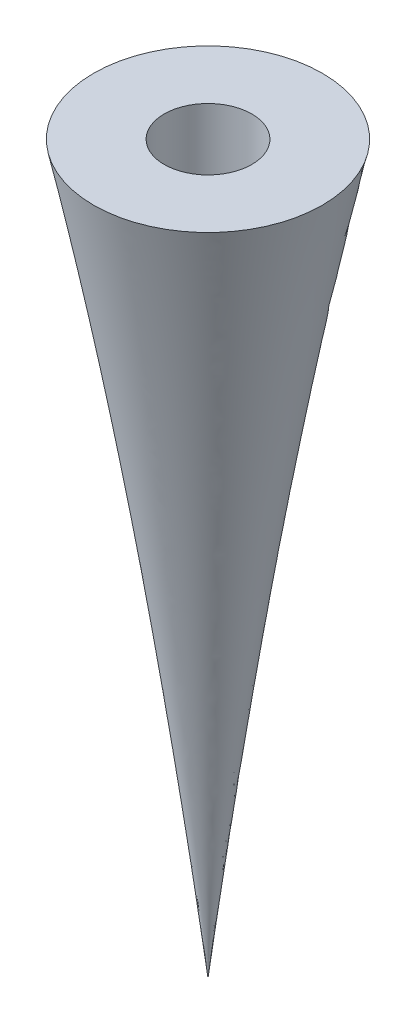
ISO-10303-21;
HEADER;
FILE_DESCRIPTION(('STEP AP214'),'2;1');
FILE_NAME('part.step','',(''),(''),'','','');
FILE_SCHEMA(('AUTOMOTIVE_DESIGN { 1 0 10303 214 1 1 1 1 }'));
ENDSEC;
DATA;
#1=APPLICATION_CONTEXT('core data for automotive mechanical design processes');
#2=APPLICATION_PROTOCOL_DEFINITION('international standard','automotive_design',2000,#1);
#3=PRODUCT_CONTEXT('',#1,'mechanical');
#4=PRODUCT('Part','Part','',(#3));
#5=PRODUCT_RELATED_PRODUCT_CATEGORY('part','',(#4));
#6=PRODUCT_DEFINITION_FORMATION('','',#4);
#7=PRODUCT_DEFINITION_CONTEXT('part definition',#1,'design');
#8=PRODUCT_DEFINITION('design','',#6,#7);
#9=PRODUCT_DEFINITION_SHAPE('','',#8);
#10=(LENGTH_UNIT() NAMED_UNIT(*) SI_UNIT(.MILLI.,.METRE.));
#11=(NAMED_UNIT(*) PLANE_ANGLE_UNIT() SI_UNIT($,.RADIAN.));
#12=(NAMED_UNIT(*) SI_UNIT($,.STERADIAN.) SOLID_ANGLE_UNIT());
#13=UNCERTAINTY_MEASURE_WITH_UNIT(LENGTH_MEASURE(1.E-05),#10,'distance_accuracy_value','');
#14=(GEOMETRIC_REPRESENTATION_CONTEXT(3) GLOBAL_UNCERTAINTY_ASSIGNED_CONTEXT((#13)) GLOBAL_UNIT_ASSIGNED_CONTEXT((#10,
#11,#12)) REPRESENTATION_CONTEXT('',''));
#15=CARTESIAN_POINT('',(0.,0.,0.));
#16=DIRECTION('',(0.,0.,1.));
#17=DIRECTION('',(1.,0.,0.));
#18=AXIS2_PLACEMENT_3D('',#15,#16,#17);
#19=CARTESIAN_POINT('',(0.,-22.5,0.));
#20=DIRECTION('',(0.,-1.,0.));
#21=DIRECTION('',(0.,0.,-1.));
#22=AXIS2_PLACEMENT_3D('',#19,#20,#21);
#23=PLANE('',#22);
#24=CARTESIAN_POINT('',(0.,-22.5,0.));
#25=DIRECTION('',(0.,-1.,0.));
#26=DIRECTION('',(0.,0.,-1.));
#27=AXIS2_PLACEMENT_3D('',#24,#25,#26);
#28=CIRCLE('',#27,4.14304083359019);
#29=CARTESIAN_POINT('',(0.,-22.5,-4.14304083359019));
#30=VERTEX_POINT('',#29);
#31=EDGE_CURVE('E11',#30,#30,#28,.T.);
#32=ORIENTED_EDGE('',*,*,#31,.F.);
#33=EDGE_LOOP('',(#32));
#34=FACE_BOUND('',#33,.T.);
#35=CARTESIAN_POINT('',(0.,-22.5,0.));
#36=DIRECTION('',(0.,-1.,0.));
#37=DIRECTION('',(0.,0.,-1.));
#38=AXIS2_PLACEMENT_3D('',#35,#36,#37);
#39=CIRCLE('',#38,1.5875);
#40=CARTESIAN_POINT('',(0.,-22.5,-1.5875));
#41=VERTEX_POINT('',#40);
#42=EDGE_CURVE('E56',#41,#41,#39,.T.);
#43=ORIENTED_EDGE('',*,*,#42,.T.);
#44=EDGE_LOOP('',(#43));
#45=FACE_BOUND('',#44,.T.);
#46=ADVANCED_FACE('F37',(#34,#45),#23,.F.);
#47=CARTESIAN_POINT('',(0.,0.6058,14.8325));
#48=CARTESIAN_POINT('',(0.,0.594107912206373,14.7865895270144));
#49=CARTESIAN_POINT('',(0.,0.577188139103916,14.7201518813473));
#50=CARTESIAN_POINT('',(0.,0.555651214039472,14.6369424777007));
#51=CARTESIAN_POINT('',(0.,0.541606050783031,14.5846289830644));
#52=CARTESIAN_POINT('',(0.,0.529056302239419,14.5386947822118));
#53=CARTESIAN_POINT('',(0.,0.516807177505447,14.4961158928496));
#54=CARTESIAN_POINT('',(0.,0.504752713045072,14.4553773234105));
#55=CARTESIAN_POINT('',(0.,0.492601585785411,14.4157038858794));
#56=CARTESIAN_POINT('',(0.,0.480213977650478,14.3766087246224));
#57=CARTESIAN_POINT('',(0.,0.467258765104925,14.3378230659763));
#58=CARTESIAN_POINT('',(0.,0.453804958758428,14.2990732958135));
#59=CARTESIAN_POINT('',(0.,0.439967713657216,14.2600774768196));
#60=CARTESIAN_POINT('',(0.,0.425142488790428,14.2208329363449));
#61=CARTESIAN_POINT('',(0.,0.4098284985807,14.1810035447542));
#62=CARTESIAN_POINT('',(0.,0.393427939959309,14.1406392257569));
#63=CARTESIAN_POINT('',(0.,0.376264866104305,14.0995398273927));
#64=CARTESIAN_POINT('',(0.,0.358051467963397,14.0576431881332));
#65=CARTESIAN_POINT('',(0.,0.338576094782098,14.0150036261546));
#66=CARTESIAN_POINT('',(0.,0.318244003719504,13.971270318355));
#67=CARTESIAN_POINT('',(0.,0.296334647509333,13.9267164776812));
#68=CARTESIAN_POINT('',(0.,0.273357563658569,13.8809173400225));
#69=CARTESIAN_POINT('',(0.,0.248879897051767,13.8340124492675));
#70=CARTESIAN_POINT('',(0.,0.222646856256437,13.785997303938));
#71=CARTESIAN_POINT('',(0.,0.195147367380525,13.7365455109421));
#72=CARTESIAN_POINT('',(0.,0.165637059045072,13.6858804172271));
#73=CARTESIAN_POINT('',(0.,0.134329980775806,13.6338325600107));
#74=CARTESIAN_POINT('',(0.,0.101238986386573,13.5802022354748));
#75=CARTESIAN_POINT('',(0.,0.0658290973155611,13.5251969847291));
#76=CARTESIAN_POINT('',(0.,0.0283943757511445,13.4684899779255));
#77=CARTESIAN_POINT('',(0.,-0.0115279815246818,13.4102184968625));
#78=CARTESIAN_POINT('',(0.,-0.053791022533644,13.3501682777678));
#79=CARTESIAN_POINT('',(0.,-0.0989003105572554,13.2884706537331));
#80=CARTESIAN_POINT('',(0.,-0.146603334827948,13.224788811436));
#81=CARTESIAN_POINT('',(0.,-0.197326807689376,13.1592412073682));
#82=CARTESIAN_POINT('',(0.,-0.25134118131284,13.0918552957949));
#83=CARTESIAN_POINT('',(0.,-0.308401649274786,13.0222335221298));
#84=CARTESIAN_POINT('',(0.,-0.369268692635678,12.9507331865607));
#85=CARTESIAN_POINT('',(0.,-0.433607317218442,12.8768449795842));
#86=CARTESIAN_POINT('',(0.,-0.502166919636169,12.8009428332164));
#87=CARTESIAN_POINT('',(0.,-0.574690204109054,12.7225588793487));
#88=CARTESIAN_POINT('',(0.,-0.651653184331904,12.6418064704389));
#89=CARTESIAN_POINT('',(0.,-0.733330072405864,12.5586317125741));
#90=CARTESIAN_POINT('',(0.,-0.820056033341306,12.4730078627439));
#91=CARTESIAN_POINT('',(0.,-0.911877966577275,12.3846066555786));
#92=CARTESIAN_POINT('',(0.,-1.00941352533373,12.2936559430722));
#93=CARTESIAN_POINT('',(0.,-1.11280957769506,12.1999366202946));
#94=CARTESIAN_POINT('',(0.,-1.22229215791659,12.1031812344031));
#95=CARTESIAN_POINT('',(0.,-1.33855084981937,12.0036585887043));
#96=CARTESIAN_POINT('',(0.,-1.4616943659355,11.901000776834));
#97=CARTESIAN_POINT('',(0.,-1.59227219099499,11.795279130824));
#98=CARTESIAN_POINT('',(0.,-1.73073886868532,11.6864285163609));
#99=CARTESIAN_POINT('',(0.,-1.8774098940514,11.5741526932877));
#100=CARTESIAN_POINT('',(0.,-2.03292930547564,11.4585363944359));
#101=CARTESIAN_POINT('',(0.,-2.19775156618193,11.3394410786376));
#102=CARTESIAN_POINT('',(0.,-2.37258693814505,11.2169063056099));
#103=CARTESIAN_POINT('',(0.,-2.55771815912039,11.0904562327673));
#104=CARTESIAN_POINT('',(0.,-2.75407846705841,10.9603393723807));
#105=CARTESIAN_POINT('',(0.,-2.96226792085158,10.8264031349356));
#106=CARTESIAN_POINT('',(0.,-3.18288167787418,10.6883222135904));
#107=CARTESIAN_POINT('',(0.,-3.41688237704983,10.5463887987382));
#108=CARTESIAN_POINT('',(0.,-3.66485353168699,10.3999820056218));
#109=CARTESIAN_POINT('',(0.,-3.92789389440654,10.2493813351734));
#110=CARTESIAN_POINT('',(0.,-4.20696952602156,10.0945336154804));
#111=CARTESIAN_POINT('',(0.,-4.50278114437961,9.93478729038151));
#112=CARTESIAN_POINT('',(0.,-4.81672002941785,9.77060052593263));
#113=CARTESIAN_POINT('',(0.,-5.14984667526825,9.60169236533696));
#114=CARTESIAN_POINT('',(0.,-5.50326598993471,9.42766193069263));
#115=CARTESIAN_POINT('',(0.,-5.87847567355671,9.24877596524616));
#116=CARTESIAN_POINT('',(0.,-6.27683523776239,9.06464590052695));
#117=CARTESIAN_POINT('',(0.,-6.69990287224116,8.87533318954772));
#118=CARTESIAN_POINT('',(0.,-7.14934112072802,8.68051663843084));
#119=CARTESIAN_POINT('',(0.,-7.6268977172647,8.48011918189116));
#120=CARTESIAN_POINT('',(0.,-8.13459334514917,8.27419422024078));
#121=CARTESIAN_POINT('',(0.,-8.67434194197511,8.0621736969138));
#122=CARTESIAN_POINT('',(0.,-9.24861769698138,7.84447304620219));
#123=CARTESIAN_POINT('',(0.,-9.85965235775611,7.62037854638359));
#124=CARTESIAN_POINT('',(0.,-10.5102391617322,7.39014363419455));
#125=CARTESIAN_POINT('',(0.,-11.2032639249178,7.15351637005612));
#126=CARTESIAN_POINT('',(0.,-11.9418162721898,6.91022293020803));
#127=CARTESIAN_POINT('',(0.,-12.7294073166303,6.66040936588325));
#128=CARTESIAN_POINT('',(0.,-13.5696190221014,6.40346386788496));
#129=CARTESIAN_POINT('',(0.,-14.4666607467803,6.13955877045744));
#130=CARTESIAN_POINT('',(0.,-15.4250458713218,5.86859751032395));
#131=CARTESIAN_POINT('',(0.,-16.4495749999204,5.58995817963725));
#132=CARTESIAN_POINT('',(0.,-17.5458705102198,5.30410545004161));
#133=CARTESIAN_POINT('',(0.,-18.7197166221722,5.01024616877044));
#134=CARTESIAN_POINT('',(0.,-19.9778842864661,4.70867968386833));
#135=CARTESIAN_POINT('',(0.,-21.3276376225704,4.39896998246256));
#136=CARTESIAN_POINT('',(0.,-22.7771278799972,4.08085745443413));
#137=CARTESIAN_POINT('',(0.,-24.3354951914395,3.75451345665229));
#138=CARTESIAN_POINT('',(0.,-26.0128583612171,3.41952793014153));
#139=CARTESIAN_POINT('',(0.,-27.8205528786836,3.07551702579519));
#140=CARTESIAN_POINT('',(0.,-29.7714222503555,2.72268418173031));
#141=CARTESIAN_POINT('',(0.,-31.879838305188,2.3605318164329));
#142=CARTESIAN_POINT('',(0.,-34.1621626622238,1.98897467652366));
#143=CARTESIAN_POINT('',(0.,-36.636974891812,1.60771551425199));
#144=CARTESIAN_POINT('',(0.,-39.3254802947712,1.21675626011374));
#145=CARTESIAN_POINT('',(0.,-42.2520163579807,0.815801597413454));
#146=CARTESIAN_POINT('',(0.,-45.4444157506613,0.403306983076827));
#147=CARTESIAN_POINT('',(0.,-47.6660568580291,0.138325748640901));
#148=CARTESIAN_POINT('',(0.,-48.8258,0.));
#149=B_SPLINE_CURVE_WITH_KNOTS('',3,(#47,#48,#49,#50,#51,#52,#53,#54,#55,#56,#57,#58,#59,#60,
#61,#62,#63,#64,#65,#66,#67,#68,#69,#70,#71,#72,#73,#74,#75,#76,#77,#78,#79,#80,#81,#82,#83,#84,
#85,#86,#87,#88,#89,#90,#91,#92,#93,#94,#95,#96,#97,#98,#99,#100,#101,#102,#103,#104,#105,#106,
#107,#108,#109,#110,#111,#112,#113,#114,#115,#116,#117,#118,#119,#120,#121,#122,#123,#124,#125,
#126,#127,#128,#129,#130,#131,#132,#133,#134,#135,#136,#137,#138,#139,#140,#141,#142,#143,#144,
#145,#146,#147,#148),.UNSPECIFIED.,.F.,.F.,(4,1,1,1,1,1,1,1,1,1,1,1,1,1,1,1,1,1,1,1,1,1,1,1,1,1,
1,1,1,1,1,1,1,1,1,1,1,1,1,1,1,1,1,1,1,1,1,1,1,1,1,1,1,1,1,1,1,1,1,1,1,1,1,1,1,1,1,1,1,1,1,1,1,1,
1,1,1,1,1,1,1,1,1,1,1,1,1,1,1,1,1,1,1,1,1,1,1,1,1,4),(0.,0.00268639971786465,
0.00388752415232042,0.00487373134743466,0.00575781270420472,0.00658758786129885,
0.00738598551822443,0.00816683064805866,0.00894034377952946,0.00971139124040117,
0.0104854791803002,0.0112662694048164,0.0120575835173272,0.0128642058125804,0.0136858750454206,
0.0145280011426551,0.0153897174782899,0.0162761959487741,0.017186037284947,0.0181243487028412,
0.0190913652745111,0.0200915024237446,0.0211242135235046,0.0221937859605704,0.023299910267619,
0.024448713701066,0.0256378225610593,0.0268730893421841,0.0281579793861846,0.029490658260886,
0.030878235533799,0.0323216666491402,0.0338243190503442,0.0353899048795117,0.0370211167018488,
0.0387212515780134,0.0404940211099502,0.0423453634405956,0.0442765691925014,0.0462935359064858,
0.0484005081925963,0.0506018526936621,0.0529033839282631,0.055310916158337,0.0578290877441769,
0.0604651622387457,0.0632237092344786,0.0661137810787376,0.0691427306257942,0.0723142924187423,
0.0756402924170954,0.079129636062662,0.082787821063172,0.0866284162916928,0.090659818227387,
0.0948937358653085,0.0993407719387853,0.104016432969499,0.10893049778877,0.114098239225188,
0.119534774427684,0.125258903679969,0.13128473184462,0.137631752293137,0.144321680770213,
0.151373222436024,0.158810235369236,0.166659266463232,0.17494277725284,0.183694449195439,
0.192940456247835,0.202718270686926,0.21306062028016,0.224006047428867,0.235599981204905,
0.247884807623142,0.260909978029779,0.274731834388955,0.289408721084207,0.305001629052581,
0.321583098658407,0.339229091768819,0.358021890550831,0.378056498764504,0.399433010339709,
0.422263422708781,0.446671009039493,0.472795467262415,0.500787451756706,0.530817523019995,
0.563076364208029,0.597777275001215,0.635158941175366,0.67549134588414,0.719081884943624,
0.766277674896637,0.817476572882521,0.873132107831789,0.933772305801132,1.),.UNSPECIFIED.);
#150=CARTESIAN_POINT('',(0.,-48.8258,0.));
#151=DIRECTION('',(0.,-1.,0.));
#152=AXIS1_PLACEMENT('',#150,#151);
#153=SURFACE_OF_REVOLUTION('',#149,#152);
#154=CARTESIAN_POINT('',(0.,-48.8258,0.));
#155=VERTEX_POINT('',#154);
#156=VERTEX_LOOP('',#155);
#157=FACE_BOUND('',#156,.T.);
#158=ORIENTED_EDGE('',*,*,#31,.T.);
#159=EDGE_LOOP('',(#158));
#160=FACE_BOUND('',#159,.T.);
#161=ADVANCED_FACE('F46',(#157,#160),#153,.T.);
#162=CARTESIAN_POINT('',(0.,-27.1567818060245,0.));
#163=DIRECTION('',(0.,1.,0.));
#164=DIRECTION('',(0.,0.,1.));
#165=AXIS2_PLACEMENT_3D('',#162,#163,#164);
#166=PLANE('',#165);
#167=CARTESIAN_POINT('',(0.,-27.1567818060245,0.));
#168=DIRECTION('',(0.,-1.,0.));
#169=DIRECTION('',(0.,0.,-1.));
#170=AXIS2_PLACEMENT_3D('',#167,#168,#169);
#171=CIRCLE('',#170,1.5875);
#172=CARTESIAN_POINT('',(0.,-27.1567818060245,-1.5875));
#173=VERTEX_POINT('',#172);
#174=EDGE_CURVE('E43',#173,#173,#171,.T.);
#175=ORIENTED_EDGE('',*,*,#174,.F.);
#176=EDGE_LOOP('',(#175));
#177=FACE_BOUND('',#176,.T.);
#178=ADVANCED_FACE('F49',(#177),#166,.T.);
#179=CARTESIAN_POINT('',(0.,-48.8258,0.));
#180=DIRECTION('',(0.,-1.,0.));
#181=DIRECTION('',(0.,0.,-1.));
#182=AXIS2_PLACEMENT_3D('',#179,#180,#181);
#183=CYLINDRICAL_SURFACE('',#182,1.5875);
#184=ORIENTED_EDGE('',*,*,#174,.T.);
#185=EDGE_LOOP('',(#184));
#186=FACE_BOUND('',#185,.T.);
#187=ORIENTED_EDGE('',*,*,#42,.F.);
#188=EDGE_LOOP('',(#187));
#189=FACE_BOUND('',#188,.T.);
#190=ADVANCED_FACE('F70',(#186,#189),#183,.F.);
#191=CLOSED_SHELL('',(#46,#161,#178,#190));
#192=MANIFOLD_SOLID_BREP('B2',#191);
#193=ADVANCED_BREP_SHAPE_REPRESENTATION('',(#18,#192),#14);
#194=SHAPE_DEFINITION_REPRESENTATION(#9,#193);
ENDSEC;
END-ISO-10303-21;
